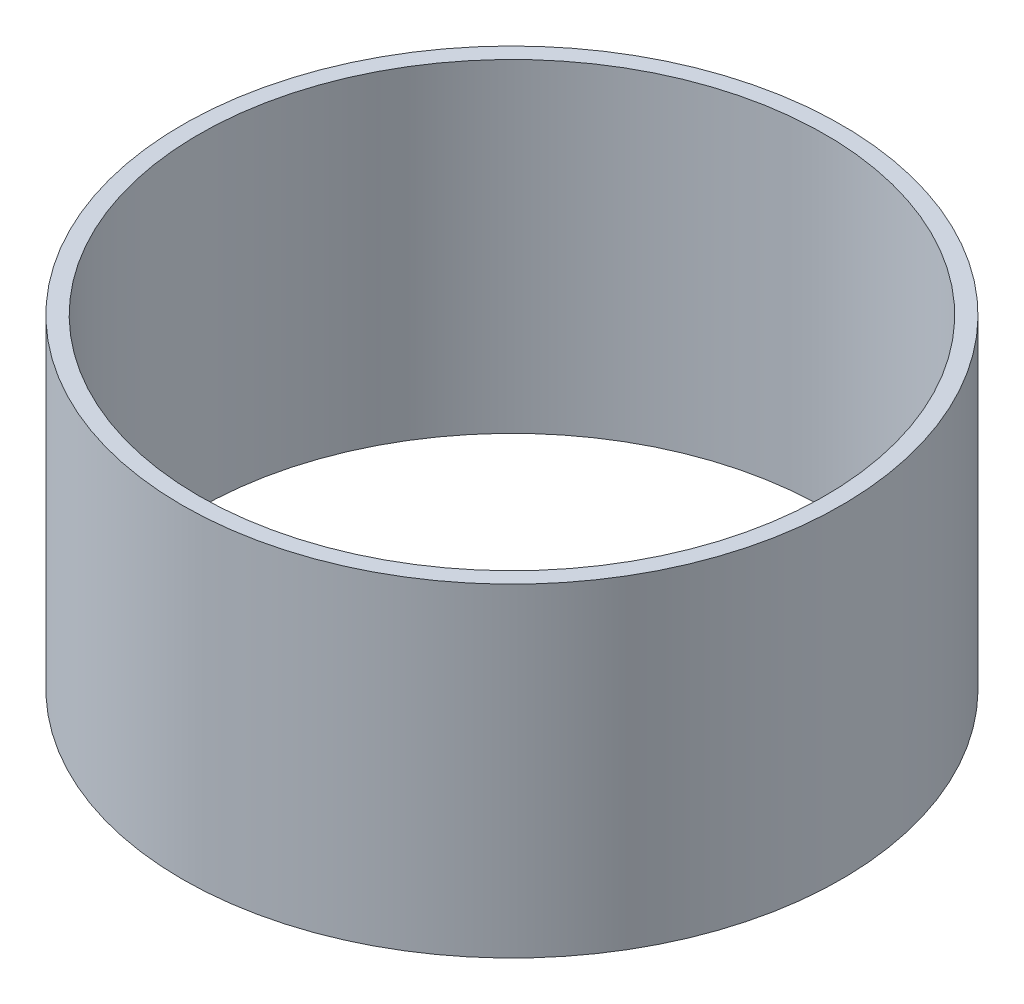
ISO-10303-21;
HEADER;
FILE_DESCRIPTION(('STEP AP214'),'2;1');
FILE_NAME('part.step','',(''),(''),'','','');
FILE_SCHEMA(('AUTOMOTIVE_DESIGN { 1 0 10303 214 1 1 1 1 }'));
ENDSEC;
DATA;
#1=APPLICATION_CONTEXT('core data for automotive mechanical design processes');
#2=APPLICATION_PROTOCOL_DEFINITION('international standard','automotive_design',2000,#1);
#3=PRODUCT_CONTEXT('',#1,'mechanical');
#4=PRODUCT('Part','Part','',(#3));
#5=PRODUCT_RELATED_PRODUCT_CATEGORY('part','',(#4));
#6=PRODUCT_DEFINITION_FORMATION('','',#4);
#7=PRODUCT_DEFINITION_CONTEXT('part definition',#1,'design');
#8=PRODUCT_DEFINITION('design','',#6,#7);
#9=PRODUCT_DEFINITION_SHAPE('','',#8);
#10=(LENGTH_UNIT() NAMED_UNIT(*) SI_UNIT(.MILLI.,.METRE.));
#11=(NAMED_UNIT(*) PLANE_ANGLE_UNIT() SI_UNIT($,.RADIAN.));
#12=(NAMED_UNIT(*) SI_UNIT($,.STERADIAN.) SOLID_ANGLE_UNIT());
#13=UNCERTAINTY_MEASURE_WITH_UNIT(LENGTH_MEASURE(1.E-05),#10,'distance_accuracy_value','');
#14=(GEOMETRIC_REPRESENTATION_CONTEXT(3) GLOBAL_UNCERTAINTY_ASSIGNED_CONTEXT((#13)) GLOBAL_UNIT_ASSIGNED_CONTEXT((#10,
#11,#12)) REPRESENTATION_CONTEXT('',''));
#15=CARTESIAN_POINT('',(0.,0.,0.));
#16=DIRECTION('',(0.,0.,1.));
#17=DIRECTION('',(1.,0.,0.));
#18=AXIS2_PLACEMENT_3D('',#15,#16,#17);
#19=CARTESIAN_POINT('',(0.,39.3,0.));
#20=DIRECTION('',(0.,1.,0.));
#21=DIRECTION('',(0.,0.,1.));
#22=AXIS2_PLACEMENT_3D('',#19,#20,#21);
#23=PLANE('',#22);
#24=CARTESIAN_POINT('',(0.,39.3,0.));
#25=DIRECTION('',(0.,1.,0.));
#26=DIRECTION('',(0.,0.,1.));
#27=AXIS2_PLACEMENT_3D('',#24,#25,#26);
#28=CIRCLE('',#27,40.);
#29=CARTESIAN_POINT('',(0.,39.3,40.));
#30=VERTEX_POINT('',#29);
#31=EDGE_CURVE('E10',#30,#30,#28,.T.);
#32=ORIENTED_EDGE('',*,*,#31,.T.);
#33=EDGE_LOOP('',(#32));
#34=FACE_BOUND('',#33,.T.);
#35=CARTESIAN_POINT('',(0.,39.3,0.));
#36=DIRECTION('',(0.,1.,0.));
#37=DIRECTION('',(0.,0.,1.));
#38=AXIS2_PLACEMENT_3D('',#35,#36,#37);
#39=CIRCLE('',#38,38.);
#40=CARTESIAN_POINT('',(0.,39.3,38.));
#41=VERTEX_POINT('',#40);
#42=EDGE_CURVE('E50',#41,#41,#39,.T.);
#43=ORIENTED_EDGE('',*,*,#42,.F.);
#44=EDGE_LOOP('',(#43));
#45=FACE_BOUND('',#44,.T.);
#46=ADVANCED_FACE('F37',(#34,#45),#23,.T.);
#47=CARTESIAN_POINT('',(0.,0.,0.));
#48=DIRECTION('',(0.,1.,0.));
#49=DIRECTION('',(0.,0.,1.));
#50=AXIS2_PLACEMENT_3D('',#47,#48,#49);
#51=PLANE('',#50);
#52=CARTESIAN_POINT('',(0.,0.,0.));
#53=DIRECTION('',(0.,1.,0.));
#54=DIRECTION('',(0.,0.,1.));
#55=AXIS2_PLACEMENT_3D('',#52,#53,#54);
#56=CIRCLE('',#55,40.);
#57=CARTESIAN_POINT('',(0.,0.,40.));
#58=VERTEX_POINT('',#57);
#59=EDGE_CURVE('E41',#58,#58,#56,.T.);
#60=ORIENTED_EDGE('',*,*,#59,.F.);
#61=EDGE_LOOP('',(#60));
#62=FACE_BOUND('',#61,.T.);
#63=CARTESIAN_POINT('',(0.,0.,0.));
#64=DIRECTION('',(0.,1.,0.));
#65=DIRECTION('',(0.,0.,1.));
#66=AXIS2_PLACEMENT_3D('',#63,#64,#65);
#67=CIRCLE('',#66,38.);
#68=CARTESIAN_POINT('',(0.,0.,38.));
#69=VERTEX_POINT('',#68);
#70=EDGE_CURVE('E52',#69,#69,#67,.T.);
#71=ORIENTED_EDGE('',*,*,#70,.T.);
#72=EDGE_LOOP('',(#71));
#73=FACE_BOUND('',#72,.T.);
#74=ADVANCED_FACE('F64',(#62,#73),#51,.F.);
#75=CARTESIAN_POINT('',(0.,39.3,0.));
#76=DIRECTION('',(0.,-1.,0.));
#77=DIRECTION('',(0.,0.,-1.));
#78=AXIS2_PLACEMENT_3D('',#75,#76,#77);
#79=CYLINDRICAL_SURFACE('',#78,40.);
#80=ORIENTED_EDGE('',*,*,#31,.F.);
#81=EDGE_LOOP('',(#80));
#82=FACE_BOUND('',#81,.T.);
#83=ORIENTED_EDGE('',*,*,#59,.T.);
#84=EDGE_LOOP('',(#83));
#85=FACE_BOUND('',#84,.T.);
#86=ADVANCED_FACE('F39',(#82,#85),#79,.T.);
#87=CARTESIAN_POINT('',(0.,39.3,0.));
#88=DIRECTION('',(0.,-1.,0.));
#89=DIRECTION('',(0.,0.,-1.));
#90=AXIS2_PLACEMENT_3D('',#87,#88,#89);
#91=CYLINDRICAL_SURFACE('',#90,38.);
#92=ORIENTED_EDGE('',*,*,#42,.T.);
#93=EDGE_LOOP('',(#92));
#94=FACE_BOUND('',#93,.T.);
#95=ORIENTED_EDGE('',*,*,#70,.F.);
#96=EDGE_LOOP('',(#95));
#97=FACE_BOUND('',#96,.T.);
#98=ADVANCED_FACE('F60',(#94,#97),#91,.F.);
#99=CLOSED_SHELL('',(#46,#74,#86,#98));
#100=MANIFOLD_SOLID_BREP('B2',#99);
#101=ADVANCED_BREP_SHAPE_REPRESENTATION('',(#18,#100),#14);
#102=SHAPE_DEFINITION_REPRESENTATION(#9,#101);
ENDSEC;
END-ISO-10303-21;
